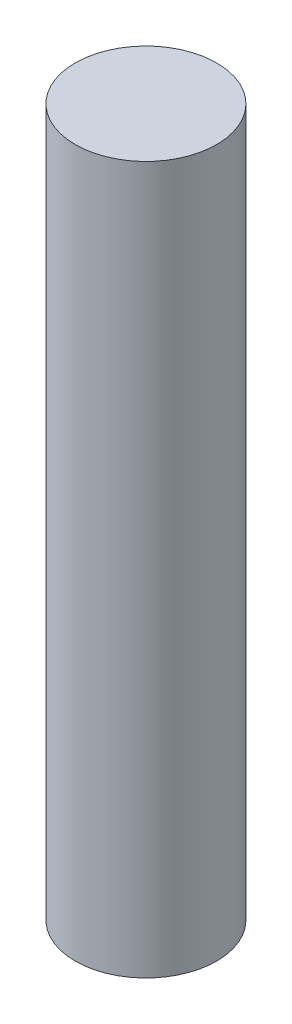
ISO-10303-21;
HEADER;
FILE_DESCRIPTION(('STEP AP214'),'2;1');
FILE_NAME('part.step','',(''),(''),'','','');
FILE_SCHEMA(('AUTOMOTIVE_DESIGN { 1 0 10303 214 1 1 1 1 }'));
ENDSEC;
DATA;
#1=APPLICATION_CONTEXT('core data for automotive mechanical design processes');
#2=APPLICATION_PROTOCOL_DEFINITION('international standard','automotive_design',2000,#1);
#3=PRODUCT_CONTEXT('',#1,'mechanical');
#4=PRODUCT('Part','Part','',(#3));
#5=PRODUCT_RELATED_PRODUCT_CATEGORY('part','',(#4));
#6=PRODUCT_DEFINITION_FORMATION('','',#4);
#7=PRODUCT_DEFINITION_CONTEXT('part definition',#1,'design');
#8=PRODUCT_DEFINITION('design','',#6,#7);
#9=PRODUCT_DEFINITION_SHAPE('','',#8);
#10=(LENGTH_UNIT() NAMED_UNIT(*) SI_UNIT(.MILLI.,.METRE.));
#11=(NAMED_UNIT(*) PLANE_ANGLE_UNIT() SI_UNIT($,.RADIAN.));
#12=(NAMED_UNIT(*) SI_UNIT($,.STERADIAN.) SOLID_ANGLE_UNIT());
#13=UNCERTAINTY_MEASURE_WITH_UNIT(LENGTH_MEASURE(1.E-05),#10,'distance_accuracy_value','');
#14=(GEOMETRIC_REPRESENTATION_CONTEXT(3) GLOBAL_UNCERTAINTY_ASSIGNED_CONTEXT((#13)) GLOBAL_UNIT_ASSIGNED_CONTEXT((#10,
#11,#12)) REPRESENTATION_CONTEXT('',''));
#15=CARTESIAN_POINT('',(0.,0.,0.));
#16=DIRECTION('',(0.,0.,1.));
#17=DIRECTION('',(1.,0.,0.));
#18=AXIS2_PLACEMENT_3D('',#15,#16,#17);
#19=CARTESIAN_POINT('',(0.,50.,0.));
#20=DIRECTION('',(0.,-1.,0.));
#21=DIRECTION('',(0.,0.,-1.));
#22=AXIS2_PLACEMENT_3D('',#19,#20,#21);
#23=CYLINDRICAL_SURFACE('',#22,5.);
#24=CARTESIAN_POINT('',(0.,50.,0.));
#25=DIRECTION('',(0.,1.,0.));
#26=DIRECTION('',(0.,0.,1.));
#27=AXIS2_PLACEMENT_3D('',#24,#25,#26);
#28=CIRCLE('',#27,5.);
#29=CARTESIAN_POINT('',(0.,50.,5.));
#30=VERTEX_POINT('',#29);
#31=EDGE_CURVE('E10',#30,#30,#28,.T.);
#32=ORIENTED_EDGE('',*,*,#31,.F.);
#33=EDGE_LOOP('',(#32));
#34=FACE_BOUND('',#33,.T.);
#35=CARTESIAN_POINT('',(0.,0.,0.));
#36=DIRECTION('',(0.,1.,0.));
#37=DIRECTION('',(0.,0.,1.));
#38=AXIS2_PLACEMENT_3D('',#35,#36,#37);
#39=CIRCLE('',#38,5.);
#40=CARTESIAN_POINT('',(0.,0.,5.));
#41=VERTEX_POINT('',#40);
#42=EDGE_CURVE('E34',#41,#41,#39,.T.);
#43=ORIENTED_EDGE('',*,*,#42,.T.);
#44=EDGE_LOOP('',(#43));
#45=FACE_BOUND('',#44,.T.);
#46=ADVANCED_FACE('F31',(#34,#45),#23,.T.);
#47=CARTESIAN_POINT('',(0.,50.,0.));
#48=DIRECTION('',(0.,1.,0.));
#49=DIRECTION('',(0.,0.,1.));
#50=AXIS2_PLACEMENT_3D('',#47,#48,#49);
#51=PLANE('',#50);
#52=ORIENTED_EDGE('',*,*,#31,.T.);
#53=EDGE_LOOP('',(#52));
#54=FACE_BOUND('',#53,.T.);
#55=ADVANCED_FACE('F46',(#54),#51,.T.);
#56=CARTESIAN_POINT('',(0.,0.,0.));
#57=DIRECTION('',(0.,1.,0.));
#58=DIRECTION('',(0.,0.,1.));
#59=AXIS2_PLACEMENT_3D('',#56,#57,#58);
#60=PLANE('',#59);
#61=ORIENTED_EDGE('',*,*,#42,.F.);
#62=EDGE_LOOP('',(#61));
#63=FACE_BOUND('',#62,.T.);
#64=ADVANCED_FACE('F44',(#63),#60,.F.);
#65=CLOSED_SHELL('',(#46,#55,#64));
#66=MANIFOLD_SOLID_BREP('B2',#65);
#67=ADVANCED_BREP_SHAPE_REPRESENTATION('',(#18,#66),#14);
#68=SHAPE_DEFINITION_REPRESENTATION(#9,#67);
ENDSEC;
END-ISO-10303-21;
